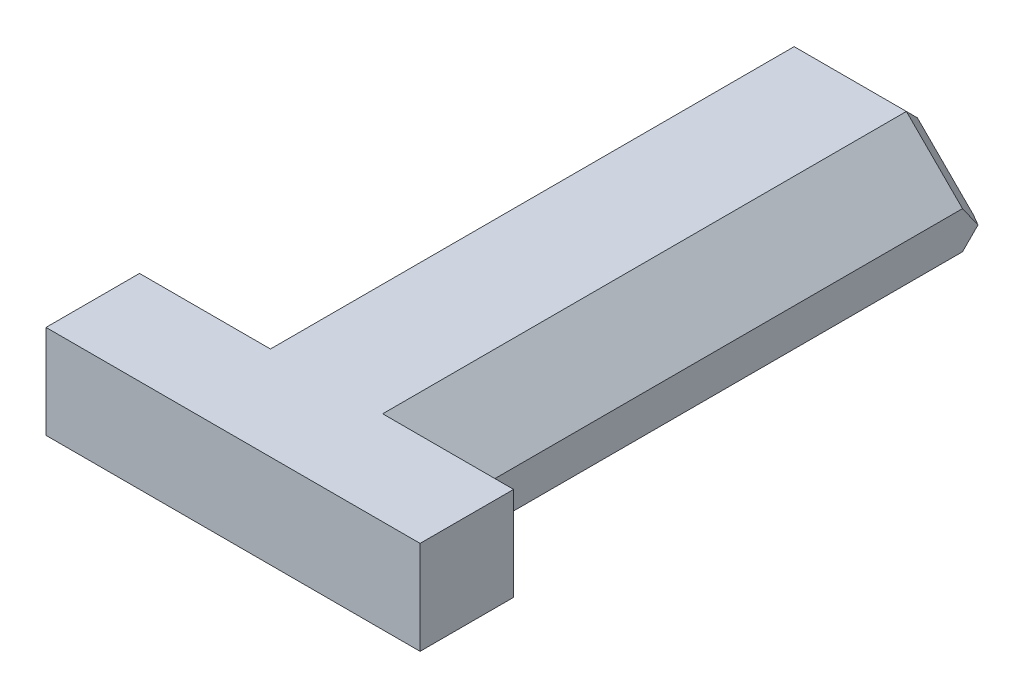
ISO-10303-21;
HEADER;
FILE_DESCRIPTION(('STEP AP214'),'2;1');
FILE_NAME('part.step','',(''),(''),'','','');
FILE_SCHEMA(('AUTOMOTIVE_DESIGN { 1 0 10303 214 1 1 1 1 }'));
ENDSEC;
DATA;
#1=APPLICATION_CONTEXT('core data for automotive mechanical design processes');
#2=APPLICATION_PROTOCOL_DEFINITION('international standard','automotive_design',2000,#1);
#3=PRODUCT_CONTEXT('',#1,'mechanical');
#4=PRODUCT('Part','Part','',(#3));
#5=PRODUCT_RELATED_PRODUCT_CATEGORY('part','',(#4));
#6=PRODUCT_DEFINITION_FORMATION('','',#4);
#7=PRODUCT_DEFINITION_CONTEXT('part definition',#1,'design');
#8=PRODUCT_DEFINITION('design','',#6,#7);
#9=PRODUCT_DEFINITION_SHAPE('','',#8);
#10=(LENGTH_UNIT() NAMED_UNIT(*) SI_UNIT(.MILLI.,.METRE.));
#11=(NAMED_UNIT(*) PLANE_ANGLE_UNIT() SI_UNIT($,.RADIAN.));
#12=(NAMED_UNIT(*) SI_UNIT($,.STERADIAN.) SOLID_ANGLE_UNIT());
#13=UNCERTAINTY_MEASURE_WITH_UNIT(LENGTH_MEASURE(1.E-05),#10,'distance_accuracy_value','');
#14=(GEOMETRIC_REPRESENTATION_CONTEXT(3) GLOBAL_UNCERTAINTY_ASSIGNED_CONTEXT((#13)) GLOBAL_UNIT_ASSIGNED_CONTEXT((#10,
#11,#12)) REPRESENTATION_CONTEXT('',''));
#15=CARTESIAN_POINT('',(0.,0.,0.));
#16=DIRECTION('',(0.,0.,1.));
#17=DIRECTION('',(1.,0.,0.));
#18=AXIS2_PLACEMENT_3D('',#15,#16,#17);
#19=CARTESIAN_POINT('',(-14.8320162190873,-4.87572662899393,29.));
#20=DIRECTION('',(0.707106781186551,-0.707106781186544,0.));
#21=DIRECTION('',(0.707106781186544,0.707106781186551,0.));
#22=AXIS2_PLACEMENT_3D('',#19,#20,#21);
#23=PLANE('',#22);
#24=DIRECTION('',(0.,0.,-1.));
#25=VECTOR('',#24,1.);
#26=CARTESIAN_POINT('',(-17.8320162190873,-7.87572662899393,29.));
#27=LINE('',#26,#25);
#28=CARTESIAN_POINT('',(-17.8320162190873,-7.87572662899393,29.));
#29=VERTEX_POINT('',#28);
#30=CARTESIAN_POINT('',(-17.8320162190873,-7.87572662899392,1.00000000000001));
#31=VERTEX_POINT('',#30);
#32=EDGE_CURVE('E170',#29,#31,#27,.T.);
#33=ORIENTED_EDGE('',*,*,#32,.F.);
#34=DIRECTION('',(-0.707106781186544,-0.707106781186551,0.));
#35=VECTOR('',#34,1.);
#36=CARTESIAN_POINT('',(-14.8320162190873,-4.87572662899393,29.));
#37=LINE('',#36,#35);
#38=CARTESIAN_POINT('',(-14.8320162190873,-4.87572662899393,29.));
#39=VERTEX_POINT('',#38);
#40=EDGE_CURVE('E226',#39,#29,#37,.T.);
#41=ORIENTED_EDGE('',*,*,#40,.F.);
#42=DIRECTION('',(0.,0.,-1.));
#43=VECTOR('',#42,1.);
#44=CARTESIAN_POINT('',(-14.8320162190873,-4.87572662899393,29.));
#45=LINE('',#44,#43);
#46=CARTESIAN_POINT('',(-14.8320162190873,-4.87572662899393,1.00000000000001));
#47=VERTEX_POINT('',#46);
#48=EDGE_CURVE('E233',#39,#47,#45,.T.);
#49=ORIENTED_EDGE('',*,*,#48,.T.);
#50=DIRECTION('',(-0.707106781186544,-0.707106781186551,0.));
#51=VECTOR('',#50,1.);
#52=CARTESIAN_POINT('',(-19.8320162190873,-9.87572662899396,1.));
#53=LINE('',#52,#51);
#54=EDGE_CURVE('E262',#47,#31,#53,.T.);
#55=ORIENTED_EDGE('',*,*,#54,.T.);
#56=EDGE_LOOP('',(#33,#41,#49,#55));
#57=FACE_BOUND('',#56,.T.);
#58=ADVANCED_FACE('F45',(#57),#23,.F.);
#59=CARTESIAN_POINT('',(-19.8320162190873,-9.87572662899396,29.));
#60=DIRECTION('',(0.,1.,0.));
#61=DIRECTION('',(0.,0.,1.));
#62=AXIS2_PLACEMENT_3D('',#59,#60,#61);
#63=PLANE('',#62);
#64=DIRECTION('',(0.,0.,1.));
#65=VECTOR('',#64,1.);
#66=CARTESIAN_POINT('',(-5.83201621908728,-9.87572662899396,0.));
#67=LINE('',#66,#65);
#68=CARTESIAN_POINT('',(-5.83201621908728,-9.87572662899396,1.));
#69=VERTEX_POINT('',#68);
#70=CARTESIAN_POINT('',(-5.83201621908728,-9.87572662899396,29.));
#71=VERTEX_POINT('',#70);
#72=EDGE_CURVE('E62',#69,#71,#67,.T.);
#73=ORIENTED_EDGE('',*,*,#72,.T.);
#74=DIRECTION('',(1.,0.,0.));
#75=VECTOR('',#74,1.);
#76=CARTESIAN_POINT('',(-11.8320162190873,-9.87572662899396,29.));
#77=LINE('',#76,#75);
#78=CARTESIAN_POINT('',(-1.83201621908728,-9.87572662899396,29.));
#79=VERTEX_POINT('',#78);
#80=EDGE_CURVE('E142',#71,#79,#77,.T.);
#81=ORIENTED_EDGE('',*,*,#80,.T.);
#82=DIRECTION('',(0.,0.,1.));
#83=VECTOR('',#82,1.);
#84=CARTESIAN_POINT('',(-1.83201621908728,-9.87572662899396,29.));
#85=LINE('',#84,#83);
#86=CARTESIAN_POINT('',(-1.83201621908728,-9.87572662899396,34.));
#87=VERTEX_POINT('',#86);
#88=EDGE_CURVE('E201',#79,#87,#85,.T.);
#89=ORIENTED_EDGE('',*,*,#88,.T.);
#90=DIRECTION('',(-1.,0.,0.));
#91=VECTOR('',#90,1.);
#92=CARTESIAN_POINT('',(-1.83201621908728,-9.87572662899396,34.));
#93=LINE('',#92,#91);
#94=CARTESIAN_POINT('',(-21.8320162190873,-9.87572662899396,34.));
#95=VERTEX_POINT('',#94);
#96=EDGE_CURVE('E204',#87,#95,#93,.T.);
#97=ORIENTED_EDGE('',*,*,#96,.T.);
#98=DIRECTION('',(0.,0.,-1.));
#99=VECTOR('',#98,1.);
#100=CARTESIAN_POINT('',(-21.8320162190873,-9.87572662899396,34.));
#101=LINE('',#100,#99);
#102=CARTESIAN_POINT('',(-21.8320162190873,-9.87572662899396,29.));
#103=VERTEX_POINT('',#102);
#104=EDGE_CURVE('E208',#95,#103,#101,.T.);
#105=ORIENTED_EDGE('',*,*,#104,.T.);
#106=CARTESIAN_POINT('',(-17.8320162190873,-9.87572662899396,29.));
#107=VERTEX_POINT('',#106);
#108=EDGE_CURVE('E153',#103,#107,#77,.T.);
#109=ORIENTED_EDGE('',*,*,#108,.T.);
#110=DIRECTION('',(0.,0.,1.));
#111=VECTOR('',#110,1.);
#112=CARTESIAN_POINT('',(-17.8320162190873,-9.87572662899396,0.));
#113=LINE('',#112,#111);
#114=CARTESIAN_POINT('',(-17.8320162190873,-9.87572662899396,1.));
#115=VERTEX_POINT('',#114);
#116=EDGE_CURVE('E173',#115,#107,#113,.T.);
#117=ORIENTED_EDGE('',*,*,#116,.F.);
#118=DIRECTION('',(1.,0.,0.));
#119=VECTOR('',#118,1.);
#120=CARTESIAN_POINT('',(-3.83201621908728,-9.87572662899396,1.));
#121=LINE('',#120,#119);
#122=EDGE_CURVE('E166',#115,#69,#121,.T.);
#123=ORIENTED_EDGE('',*,*,#122,.T.);
#124=EDGE_LOOP('',(#73,#81,#89,#97,#105,#109,#117,#123));
#125=FACE_BOUND('',#124,.T.);
#126=ADVANCED_FACE('F163',(#125),#63,.F.);
#127=CARTESIAN_POINT('',(-3.83201621908728,-9.87572662899396,29.));
#128=DIRECTION('',(-0.707106781186544,-0.707106781186551,0.));
#129=DIRECTION('',(0.707106781186551,-0.707106781186544,0.));
#130=AXIS2_PLACEMENT_3D('',#127,#128,#129);
#131=PLANE('',#130);
#132=DIRECTION('',(0.,0.,1.));
#133=VECTOR('',#132,1.);
#134=CARTESIAN_POINT('',(-5.83201621908728,-7.87572662899398,29.));
#135=LINE('',#134,#133);
#136=CARTESIAN_POINT('',(-5.83201621908728,-7.87572662899397,1.00000000000001));
#137=VERTEX_POINT('',#136);
#138=CARTESIAN_POINT('',(-5.83201621908728,-7.87572662899398,29.));
#139=VERTEX_POINT('',#138);
#140=EDGE_CURVE('E158',#137,#139,#135,.T.);
#141=ORIENTED_EDGE('',*,*,#140,.F.);
#142=DIRECTION('',(-0.707106781186551,0.707106781186544,0.));
#143=VECTOR('',#142,1.);
#144=CARTESIAN_POINT('',(-8.83201621908733,-4.87572662899396,1.));
#145=LINE('',#144,#143);
#146=CARTESIAN_POINT('',(-8.83201621908733,-4.87572662899396,1.00000000000001));
#147=VERTEX_POINT('',#146);
#148=EDGE_CURVE('E256',#137,#147,#145,.T.);
#149=ORIENTED_EDGE('',*,*,#148,.T.);
#150=DIRECTION('',(0.,0.,-1.));
#151=VECTOR('',#150,1.);
#152=CARTESIAN_POINT('',(-8.83201621908733,-4.87572662899396,29.));
#153=LINE('',#152,#151);
#154=CARTESIAN_POINT('',(-8.83201621908734,-4.87572662899395,29.));
#155=VERTEX_POINT('',#154);
#156=EDGE_CURVE('E237',#155,#147,#153,.T.);
#157=ORIENTED_EDGE('',*,*,#156,.F.);
#158=DIRECTION('',(-0.707106781186551,0.707106781186544,0.));
#159=VECTOR('',#158,1.);
#160=CARTESIAN_POINT('',(-3.83201621908728,-9.87572662899396,29.));
#161=LINE('',#160,#159);
#162=EDGE_CURVE('E230',#139,#155,#161,.T.);
#163=ORIENTED_EDGE('',*,*,#162,.F.);
#164=EDGE_LOOP('',(#141,#149,#157,#163));
#165=FACE_BOUND('',#164,.T.);
#166=ADVANCED_FACE('F297',(#165),#131,.F.);
#167=CARTESIAN_POINT('',(-14.8320162190873,-4.87572662899393,1.));
#168=DIRECTION('',(-0.500000000000002,0.499999999999997,-0.707106781186548));
#169=DIRECTION('',(0.707106781186544,0.707106781186551,0.));
#170=AXIS2_PLACEMENT_3D('',#167,#168,#169);
#171=PLANE('',#170);
#172=DIRECTION('',(-0.862856209461015,-0.357406744336596,0.357406744336594));
#173=VECTOR('',#172,1.);
#174=CARTESIAN_POINT('',(-14.5674588847898,-7.69507558123715,-1.1806510477568));
#175=LINE('',#174,#173);
#176=CARTESIAN_POINT('',(-17.8320162190873,-9.04729950424776,0.171572875253804));
#177=VERTEX_POINT('',#176);
#178=CARTESIAN_POINT('',(-17.4178026567142,-8.87572662899395,0.));
#179=VERTEX_POINT('',#178);
#180=EDGE_CURVE('E269',#177,#179,#175,.F.);
#181=ORIENTED_EDGE('',*,*,#180,.F.);
#182=DIRECTION('',(0.,0.816496580927728,0.577350269189624));
#183=VECTOR('',#182,1.);
#184=CARTESIAN_POINT('',(-17.8320162190873,-5.87572662899392,2.41421356237309));
#185=LINE('',#184,#183);
#186=EDGE_CURVE('E69',#177,#31,#185,.T.);
#187=ORIENTED_EDGE('',*,*,#186,.T.);
#188=ORIENTED_EDGE('',*,*,#54,.F.);
#189=DIRECTION('',(0.28108463771482,-0.678598344545848,-0.678598344545846));
#190=VECTOR('',#189,1.);
#191=CARTESIAN_POINT('',(-14.8320162190873,-4.87572662899393,1.));
#192=LINE('',#191,#190);
#193=CARTESIAN_POINT('',(-14.4178026567142,-5.87572662899393,0.));
#194=VERTEX_POINT('',#193);
#195=EDGE_CURVE('E154',#47,#194,#192,.T.);
#196=ORIENTED_EDGE('',*,*,#195,.T.);
#197=DIRECTION('',(0.707106781186544,0.707106781186551,0.));
#198=VECTOR('',#197,1.);
#199=CARTESIAN_POINT('',(-14.1249094379008,-5.58283341018048,0.));
#200=LINE('',#199,#198);
#201=EDGE_CURVE('E243',#179,#194,#200,.T.);
#202=ORIENTED_EDGE('',*,*,#201,.F.);
#203=EDGE_LOOP('',(#181,#187,#188,#196,#202));
#204=FACE_BOUND('',#203,.T.);
#205=ADVANCED_FACE('F285',(#204),#171,.T.);
#206=CARTESIAN_POINT('',(-3.83201621908728,-9.87572662899396,1.));
#207=DIRECTION('',(0.499999999999997,0.500000000000002,-0.707106781186549));
#208=DIRECTION('',(0.707106781186551,-0.707106781186544,0.));
#209=AXIS2_PLACEMENT_3D('',#206,#207,#208);
#210=PLANE('',#209);
#211=ORIENTED_EDGE('',*,*,#148,.F.);
#212=DIRECTION('',(0.,-0.816496580927726,-0.577350269189626));
#213=VECTOR('',#212,1.);
#214=CARTESIAN_POINT('',(-5.83201621908728,-9.2090599623273,0.0571909584179467));
#215=LINE('',#214,#213);
#216=CARTESIAN_POINT('',(-5.83201621908728,-9.04729950424777,0.17157287525382));
#217=VERTEX_POINT('',#216);
#218=EDGE_CURVE('E182',#137,#217,#215,.T.);
#219=ORIENTED_EDGE('',*,*,#218,.T.);
#220=DIRECTION('',(-0.862856209461019,0.357406744336591,-0.35740674433659));
#221=VECTOR('',#220,1.);
#222=CARTESIAN_POINT('',(-3.83201621908728,-9.87572662899396,1.));
#223=LINE('',#222,#221);
#224=CARTESIAN_POINT('',(-6.24622978146041,-8.87572662899395,0.));
#225=VERTEX_POINT('',#224);
#226=EDGE_CURVE('E188',#225,#217,#223,.F.);
#227=ORIENTED_EDGE('',*,*,#226,.F.);
#228=DIRECTION('',(0.707106781186551,-0.707106781186544,0.));
#229=VECTOR('',#228,1.);
#230=CARTESIAN_POINT('',(-4.53912300027383,-10.5828334101805,0.));
#231=LINE('',#230,#229);
#232=CARTESIAN_POINT('',(-9.24622978146043,-5.87572662899396,0.));
#233=VERTEX_POINT('',#232);
#234=EDGE_CURVE('E249',#233,#225,#231,.T.);
#235=ORIENTED_EDGE('',*,*,#234,.F.);
#236=DIRECTION('',(-0.281084637714822,-0.678598344545847,-0.678598344545847));
#237=VECTOR('',#236,1.);
#238=CARTESIAN_POINT('',(-8.83201621908733,-4.87572662899396,1.));
#239=LINE('',#238,#237);
#240=EDGE_CURVE('E272',#233,#147,#239,.F.);
#241=ORIENTED_EDGE('',*,*,#240,.T.);
#242=EDGE_LOOP('',(#211,#219,#227,#235,#241));
#243=FACE_BOUND('',#242,.T.);
#244=ADVANCED_FACE('F295',(#243),#210,.T.);
#245=CARTESIAN_POINT('',(-19.8320162190873,-9.87572662899396,1.));
#246=DIRECTION('',(0.,-0.707106781186546,-0.707106781186549));
#247=DIRECTION('',(-1.,0.,0.));
#248=AXIS2_PLACEMENT_3D('',#245,#246,#247);
#249=PLANE('',#248);
#250=ORIENTED_EDGE('',*,*,#226,.T.);
#251=DIRECTION('',(0.,-0.707106781186549,0.707106781186546));
#252=VECTOR('',#251,1.);
#253=CARTESIAN_POINT('',(-5.83201621908728,-9.87572662899396,1.));
#254=LINE('',#253,#252);
#255=EDGE_CURVE('E11',#217,#69,#254,.T.);
#256=ORIENTED_EDGE('',*,*,#255,.T.);
#257=ORIENTED_EDGE('',*,*,#122,.F.);
#258=DIRECTION('',(0.,0.707106781186549,-0.707106781186546));
#259=VECTOR('',#258,1.);
#260=CARTESIAN_POINT('',(-17.8320162190873,-9.87572662899396,1.));
#261=LINE('',#260,#259);
#262=EDGE_CURVE('E55',#115,#177,#261,.T.);
#263=ORIENTED_EDGE('',*,*,#262,.T.);
#264=ORIENTED_EDGE('',*,*,#180,.T.);
#265=DIRECTION('',(-1.,0.,0.));
#266=VECTOR('',#265,1.);
#267=CARTESIAN_POINT('',(-19.8320162190873,-8.87572662899395,0.));
#268=LINE('',#267,#266);
#269=EDGE_CURVE('E252',#225,#179,#268,.T.);
#270=ORIENTED_EDGE('',*,*,#269,.F.);
#271=EDGE_LOOP('',(#250,#256,#257,#263,#264,#270));
#272=FACE_BOUND('',#271,.T.);
#273=ADVANCED_FACE('F281',(#272),#249,.T.);
#274=CARTESIAN_POINT('',(-8.83201621908733,-4.87572662899396,29.));
#275=DIRECTION('',(0.,-1.,0.));
#276=DIRECTION('',(1.,0.,0.));
#277=AXIS2_PLACEMENT_3D('',#274,#275,#276);
#278=PLANE('',#277);
#279=ORIENTED_EDGE('',*,*,#156,.T.);
#280=DIRECTION('',(-1.,0.,0.));
#281=VECTOR('',#280,1.);
#282=CARTESIAN_POINT('',(-14.8320162190873,-4.87572662899393,1.));
#283=LINE('',#282,#281);
#284=EDGE_CURVE('E259',#147,#47,#283,.T.);
#285=ORIENTED_EDGE('',*,*,#284,.T.);
#286=ORIENTED_EDGE('',*,*,#48,.F.);
#287=DIRECTION('',(-1.,0.,0.));
#288=VECTOR('',#287,1.);
#289=CARTESIAN_POINT('',(-11.8320162190874,-4.87572662899394,29.));
#290=LINE('',#289,#288);
#291=CARTESIAN_POINT('',(-21.8320162190873,-4.8757266289939,29.));
#292=VERTEX_POINT('',#291);
#293=EDGE_CURVE('E198',#39,#292,#290,.T.);
#294=ORIENTED_EDGE('',*,*,#293,.T.);
#295=DIRECTION('',(0.,0.,1.));
#296=VECTOR('',#295,1.);
#297=CARTESIAN_POINT('',(-21.8320162190873,-4.8757266289939,34.));
#298=LINE('',#297,#296);
#299=CARTESIAN_POINT('',(-21.8320162190873,-4.8757266289939,34.));
#300=VERTEX_POINT('',#299);
#301=EDGE_CURVE('E196',#292,#300,#298,.T.);
#302=ORIENTED_EDGE('',*,*,#301,.T.);
#303=DIRECTION('',(1.,0.,0.));
#304=VECTOR('',#303,1.);
#305=CARTESIAN_POINT('',(-1.83201621908737,-4.87572662899398,34.));
#306=LINE('',#305,#304);
#307=CARTESIAN_POINT('',(-1.83201621908728,-4.87572662899398,34.));
#308=VERTEX_POINT('',#307);
#309=EDGE_CURVE('E192',#300,#308,#306,.T.);
#310=ORIENTED_EDGE('',*,*,#309,.T.);
#311=DIRECTION('',(0.,0.,-1.));
#312=VECTOR('',#311,1.);
#313=CARTESIAN_POINT('',(-1.83201621908728,-4.87572662899398,29.));
#314=LINE('',#313,#312);
#315=CARTESIAN_POINT('',(-1.83201621908728,-4.87572662899394,29.));
#316=VERTEX_POINT('',#315);
#317=EDGE_CURVE('E189',#308,#316,#314,.T.);
#318=ORIENTED_EDGE('',*,*,#317,.T.);
#319=EDGE_CURVE('E222',#316,#155,#290,.T.);
#320=ORIENTED_EDGE('',*,*,#319,.T.);
#321=EDGE_LOOP('',(#279,#285,#286,#294,#302,#310,#318,#320));
#322=FACE_BOUND('',#321,.T.);
#323=ADVANCED_FACE('F300',(#322),#278,.F.);
#324=CARTESIAN_POINT('',(0.,0.,0.));
#325=DIRECTION('',(0.,0.,-1.));
#326=DIRECTION('',(-1.,0.,0.));
#327=AXIS2_PLACEMENT_3D('',#324,#325,#326);
#328=PLANE('',#327);
#329=ORIENTED_EDGE('',*,*,#234,.T.);
#330=ORIENTED_EDGE('',*,*,#269,.T.);
#331=ORIENTED_EDGE('',*,*,#201,.T.);
#332=DIRECTION('',(1.,0.,0.));
#333=VECTOR('',#332,1.);
#334=CARTESIAN_POINT('',(-8.83201621908734,-5.87572662899396,0.));
#335=LINE('',#334,#333);
#336=EDGE_CURVE('E246',#194,#233,#335,.T.);
#337=ORIENTED_EDGE('',*,*,#336,.T.);
#338=EDGE_LOOP('',(#329,#330,#331,#337));
#339=FACE_BOUND('',#338,.T.);
#340=ADVANCED_FACE('F290',(#339),#328,.T.);
#341=CARTESIAN_POINT('',(-11.8320162190873,15.7398014990944,29.));
#342=DIRECTION('',(0.,0.,-1.));
#343=DIRECTION('',(-1.,0.,0.));
#344=AXIS2_PLACEMENT_3D('',#341,#342,#343);
#345=PLANE('',#344);
#346=ORIENTED_EDGE('',*,*,#40,.T.);
#347=DIRECTION('',(0.,-1.,0.));
#348=VECTOR('',#347,1.);
#349=CARTESIAN_POINT('',(-17.8320162190873,-9.87572662899396,29.));
#350=LINE('',#349,#348);
#351=EDGE_CURVE('E160',#29,#107,#350,.T.);
#352=ORIENTED_EDGE('',*,*,#351,.T.);
#353=ORIENTED_EDGE('',*,*,#108,.F.);
#354=DIRECTION('',(0.,-1.,0.));
#355=VECTOR('',#354,1.);
#356=CARTESIAN_POINT('',(-21.8320162190873,15.7398014990944,29.));
#357=LINE('',#356,#355);
#358=EDGE_CURVE('E193',#292,#103,#357,.T.);
#359=ORIENTED_EDGE('',*,*,#358,.F.);
#360=ORIENTED_EDGE('',*,*,#293,.F.);
#361=EDGE_LOOP('',(#346,#352,#353,#359,#360));
#362=FACE_BOUND('',#361,.T.);
#363=ADVANCED_FACE('F318',(#362),#345,.T.);
#364=CARTESIAN_POINT('',(-21.8320162190873,15.7398014990944,34.));
#365=DIRECTION('',(-1.,0.,0.));
#366=DIRECTION('',(0.,0.,1.));
#367=AXIS2_PLACEMENT_3D('',#364,#365,#366);
#368=PLANE('',#367);
#369=ORIENTED_EDGE('',*,*,#301,.F.);
#370=ORIENTED_EDGE('',*,*,#358,.T.);
#371=ORIENTED_EDGE('',*,*,#104,.F.);
#372=DIRECTION('',(0.,-1.,0.));
#373=VECTOR('',#372,1.);
#374=CARTESIAN_POINT('',(-21.8320162190873,15.7398014990944,34.));
#375=LINE('',#374,#373);
#376=EDGE_CURVE('E214',#300,#95,#375,.T.);
#377=ORIENTED_EDGE('',*,*,#376,.F.);
#378=EDGE_LOOP('',(#369,#370,#371,#377));
#379=FACE_BOUND('',#378,.T.);
#380=ADVANCED_FACE('F313',(#379),#368,.T.);
#381=CARTESIAN_POINT('',(-1.83201621908728,15.7398014990944,34.));
#382=DIRECTION('',(0.,0.,1.));
#383=DIRECTION('',(1.,0.,0.));
#384=AXIS2_PLACEMENT_3D('',#381,#382,#383);
#385=PLANE('',#384);
#386=ORIENTED_EDGE('',*,*,#309,.F.);
#387=ORIENTED_EDGE('',*,*,#376,.T.);
#388=ORIENTED_EDGE('',*,*,#96,.F.);
#389=DIRECTION('',(0.,-1.,0.));
#390=VECTOR('',#389,1.);
#391=CARTESIAN_POINT('',(-1.83201621908728,15.7398014990944,34.));
#392=LINE('',#391,#390);
#393=EDGE_CURVE('E217',#308,#87,#392,.T.);
#394=ORIENTED_EDGE('',*,*,#393,.F.);
#395=EDGE_LOOP('',(#386,#387,#388,#394));
#396=FACE_BOUND('',#395,.T.);
#397=ADVANCED_FACE('F366',(#396),#385,.T.);
#398=CARTESIAN_POINT('',(-1.83201621908728,15.7398014990944,29.));
#399=DIRECTION('',(1.,0.,0.));
#400=DIRECTION('',(0.,0.,-1.));
#401=AXIS2_PLACEMENT_3D('',#398,#399,#400);
#402=PLANE('',#401);
#403=ORIENTED_EDGE('',*,*,#317,.F.);
#404=ORIENTED_EDGE('',*,*,#393,.T.);
#405=ORIENTED_EDGE('',*,*,#88,.F.);
#406=DIRECTION('',(0.,-1.,0.));
#407=VECTOR('',#406,1.);
#408=CARTESIAN_POINT('',(-1.83201621908728,15.7398014990944,29.));
#409=LINE('',#408,#407);
#410=EDGE_CURVE('E148',#316,#79,#409,.T.);
#411=ORIENTED_EDGE('',*,*,#410,.F.);
#412=EDGE_LOOP('',(#403,#404,#405,#411));
#413=FACE_BOUND('',#412,.T.);
#414=ADVANCED_FACE('F306',(#413),#402,.T.);
#415=ORIENTED_EDGE('',*,*,#80,.F.);
#416=DIRECTION('',(0.,1.,0.));
#417=VECTOR('',#416,1.);
#418=CARTESIAN_POINT('',(-5.83201621908728,-9.87572662899396,29.));
#419=LINE('',#418,#417);
#420=EDGE_CURVE('E144',#71,#139,#419,.T.);
#421=ORIENTED_EDGE('',*,*,#420,.T.);
#422=ORIENTED_EDGE('',*,*,#162,.T.);
#423=ORIENTED_EDGE('',*,*,#319,.F.);
#424=ORIENTED_EDGE('',*,*,#410,.T.);
#425=EDGE_LOOP('',(#415,#421,#422,#423,#424));
#426=FACE_BOUND('',#425,.T.);
#427=ADVANCED_FACE('F143',(#426),#345,.T.);
#428=CARTESIAN_POINT('',(-8.83201621908733,-4.87572662899396,1.));
#429=DIRECTION('',(0.,0.707106781186547,-0.707106781186548));
#430=DIRECTION('',(1.,0.,0.));
#431=AXIS2_PLACEMENT_3D('',#428,#429,#430);
#432=PLANE('',#431);
#433=ORIENTED_EDGE('',*,*,#240,.F.);
#434=ORIENTED_EDGE('',*,*,#336,.F.);
#435=ORIENTED_EDGE('',*,*,#195,.F.);
#436=ORIENTED_EDGE('',*,*,#284,.F.);
#437=EDGE_LOOP('',(#433,#434,#435,#436));
#438=FACE_BOUND('',#437,.T.);
#439=ADVANCED_FACE('F48',(#438),#432,.T.);
#440=CARTESIAN_POINT('',(-17.8320162190873,-9.87572662899396,0.));
#441=DIRECTION('',(-1.,0.,0.));
#442=DIRECTION('',(0.,0.,1.));
#443=AXIS2_PLACEMENT_3D('',#440,#441,#442);
#444=PLANE('',#443);
#445=ORIENTED_EDGE('',*,*,#32,.T.);
#446=ORIENTED_EDGE('',*,*,#186,.F.);
#447=ORIENTED_EDGE('',*,*,#262,.F.);
#448=ORIENTED_EDGE('',*,*,#116,.T.);
#449=ORIENTED_EDGE('',*,*,#351,.F.);
#450=EDGE_LOOP('',(#445,#446,#447,#448,#449));
#451=FACE_BOUND('',#450,.T.);
#452=ADVANCED_FACE('F319',(#451),#444,.T.);
#453=CARTESIAN_POINT('',(-5.83201621908728,-9.87572662899396,0.));
#454=DIRECTION('',(1.,0.,0.));
#455=DIRECTION('',(0.,0.,-1.));
#456=AXIS2_PLACEMENT_3D('',#453,#454,#455);
#457=PLANE('',#456);
#458=ORIENTED_EDGE('',*,*,#140,.T.);
#459=ORIENTED_EDGE('',*,*,#420,.F.);
#460=ORIENTED_EDGE('',*,*,#72,.F.);
#461=ORIENTED_EDGE('',*,*,#255,.F.);
#462=ORIENTED_EDGE('',*,*,#218,.F.);
#463=EDGE_LOOP('',(#458,#459,#460,#461,#462));
#464=FACE_BOUND('',#463,.T.);
#465=ADVANCED_FACE('F156',(#464),#457,.T.);
#466=CLOSED_SHELL('',(#58,#126,#166,#205,#244,#273,#323,#340,#363,#380,#397,#414,#427,#439,#452,#465));
#467=MANIFOLD_SOLID_BREP('B2',#466);
#468=ADVANCED_BREP_SHAPE_REPRESENTATION('',(#18,#467),#14);
#469=SHAPE_DEFINITION_REPRESENTATION(#9,#468);
ENDSEC;
END-ISO-10303-21;
